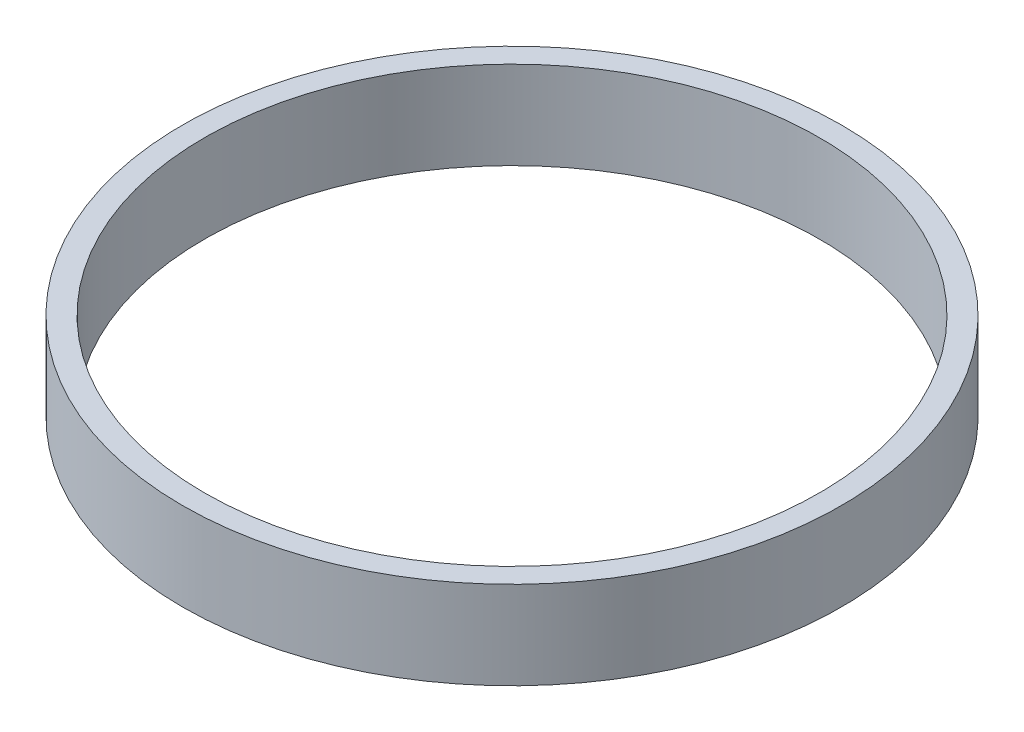
ISO-10303-21;
HEADER;
FILE_DESCRIPTION(('STEP AP214'),'2;1');
FILE_NAME('part.step','',(''),(''),'','','');
FILE_SCHEMA(('AUTOMOTIVE_DESIGN { 1 0 10303 214 1 1 1 1 }'));
ENDSEC;
DATA;
#1=APPLICATION_CONTEXT('core data for automotive mechanical design processes');
#2=APPLICATION_PROTOCOL_DEFINITION('international standard','automotive_design',2000,#1);
#3=PRODUCT_CONTEXT('',#1,'mechanical');
#4=PRODUCT('Part','Part','',(#3));
#5=PRODUCT_RELATED_PRODUCT_CATEGORY('part','',(#4));
#6=PRODUCT_DEFINITION_FORMATION('','',#4);
#7=PRODUCT_DEFINITION_CONTEXT('part definition',#1,'design');
#8=PRODUCT_DEFINITION('design','',#6,#7);
#9=PRODUCT_DEFINITION_SHAPE('','',#8);
#10=(LENGTH_UNIT() NAMED_UNIT(*) SI_UNIT(.MILLI.,.METRE.));
#11=(NAMED_UNIT(*) PLANE_ANGLE_UNIT() SI_UNIT($,.RADIAN.));
#12=(NAMED_UNIT(*) SI_UNIT($,.STERADIAN.) SOLID_ANGLE_UNIT());
#13=UNCERTAINTY_MEASURE_WITH_UNIT(LENGTH_MEASURE(1.E-05),#10,'distance_accuracy_value','');
#14=(GEOMETRIC_REPRESENTATION_CONTEXT(3) GLOBAL_UNCERTAINTY_ASSIGNED_CONTEXT((#13)) GLOBAL_UNIT_ASSIGNED_CONTEXT((#10,
#11,#12)) REPRESENTATION_CONTEXT('',''));
#15=CARTESIAN_POINT('',(0.,0.,0.));
#16=DIRECTION('',(0.,0.,1.));
#17=DIRECTION('',(1.,0.,0.));
#18=AXIS2_PLACEMENT_3D('',#15,#16,#17);
#19=CARTESIAN_POINT('',(0.,10.,0.));
#20=DIRECTION('',(0.,1.,0.));
#21=DIRECTION('',(0.,0.,1.));
#22=AXIS2_PLACEMENT_3D('',#19,#20,#21);
#23=PLANE('',#22);
#24=CARTESIAN_POINT('',(0.,10.,0.));
#25=DIRECTION('',(0.,1.,0.));
#26=DIRECTION('',(0.,0.,1.));
#27=AXIS2_PLACEMENT_3D('',#24,#25,#26);
#28=CIRCLE('',#27,37.5);
#29=CARTESIAN_POINT('',(0.,10.,37.5));
#30=VERTEX_POINT('',#29);
#31=EDGE_CURVE('E10',#30,#30,#28,.T.);
#32=ORIENTED_EDGE('',*,*,#31,.T.);
#33=EDGE_LOOP('',(#32));
#34=FACE_BOUND('',#33,.T.);
#35=CARTESIAN_POINT('',(0.,10.,0.));
#36=DIRECTION('',(0.,1.,0.));
#37=DIRECTION('',(0.,0.,1.));
#38=AXIS2_PLACEMENT_3D('',#35,#36,#37);
#39=CIRCLE('',#38,35.);
#40=CARTESIAN_POINT('',(0.,10.,35.));
#41=VERTEX_POINT('',#40);
#42=EDGE_CURVE('E42',#41,#41,#39,.T.);
#43=ORIENTED_EDGE('',*,*,#42,.F.);
#44=EDGE_LOOP('',(#43));
#45=FACE_BOUND('',#44,.T.);
#46=ADVANCED_FACE('F31',(#34,#45),#23,.T.);
#47=CARTESIAN_POINT('',(0.,0.,0.));
#48=DIRECTION('',(0.,1.,0.));
#49=DIRECTION('',(0.,0.,1.));
#50=AXIS2_PLACEMENT_3D('',#47,#48,#49);
#51=PLANE('',#50);
#52=CARTESIAN_POINT('',(0.,0.,0.));
#53=DIRECTION('',(0.,1.,0.));
#54=DIRECTION('',(0.,0.,1.));
#55=AXIS2_PLACEMENT_3D('',#52,#53,#54);
#56=CIRCLE('',#55,37.5);
#57=CARTESIAN_POINT('',(0.,0.,37.5));
#58=VERTEX_POINT('',#57);
#59=EDGE_CURVE('E35',#58,#58,#56,.T.);
#60=ORIENTED_EDGE('',*,*,#59,.F.);
#61=EDGE_LOOP('',(#60));
#62=FACE_BOUND('',#61,.T.);
#63=CARTESIAN_POINT('',(0.,0.,0.));
#64=DIRECTION('',(0.,1.,0.));
#65=DIRECTION('',(0.,0.,1.));
#66=AXIS2_PLACEMENT_3D('',#63,#64,#65);
#67=CIRCLE('',#66,35.);
#68=CARTESIAN_POINT('',(0.,0.,35.));
#69=VERTEX_POINT('',#68);
#70=EDGE_CURVE('E44',#69,#69,#67,.T.);
#71=ORIENTED_EDGE('',*,*,#70,.T.);
#72=EDGE_LOOP('',(#71));
#73=FACE_BOUND('',#72,.T.);
#74=ADVANCED_FACE('F54',(#62,#73),#51,.F.);
#75=CARTESIAN_POINT('',(0.,10.,0.));
#76=DIRECTION('',(0.,-1.,0.));
#77=DIRECTION('',(0.,0.,-1.));
#78=AXIS2_PLACEMENT_3D('',#75,#76,#77);
#79=CYLINDRICAL_SURFACE('',#78,37.5);
#80=ORIENTED_EDGE('',*,*,#31,.F.);
#81=EDGE_LOOP('',(#80));
#82=FACE_BOUND('',#81,.T.);
#83=ORIENTED_EDGE('',*,*,#59,.T.);
#84=EDGE_LOOP('',(#83));
#85=FACE_BOUND('',#84,.T.);
#86=ADVANCED_FACE('F33',(#82,#85),#79,.T.);
#87=CARTESIAN_POINT('',(0.,10.,0.));
#88=DIRECTION('',(0.,-1.,0.));
#89=DIRECTION('',(0.,0.,-1.));
#90=AXIS2_PLACEMENT_3D('',#87,#88,#89);
#91=CYLINDRICAL_SURFACE('',#90,35.);
#92=ORIENTED_EDGE('',*,*,#42,.T.);
#93=EDGE_LOOP('',(#92));
#94=FACE_BOUND('',#93,.T.);
#95=ORIENTED_EDGE('',*,*,#70,.F.);
#96=EDGE_LOOP('',(#95));
#97=FACE_BOUND('',#96,.T.);
#98=ADVANCED_FACE('F50',(#94,#97),#91,.F.);
#99=CLOSED_SHELL('',(#46,#74,#86,#98));
#100=MANIFOLD_SOLID_BREP('B2',#99);
#101=ADVANCED_BREP_SHAPE_REPRESENTATION('',(#18,#100),#14);
#102=SHAPE_DEFINITION_REPRESENTATION(#9,#101);
ENDSEC;
END-ISO-10303-21;
